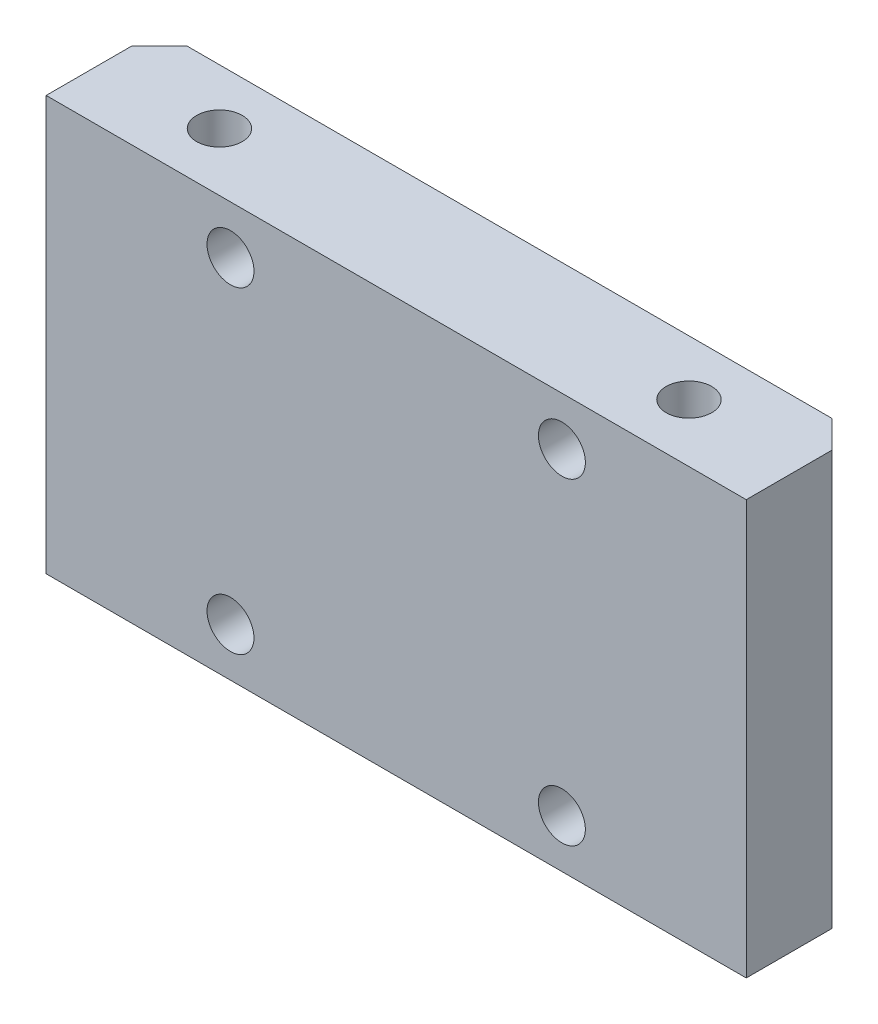
ISO-10303-21;
HEADER;
FILE_DESCRIPTION(('STEP AP214'),'2;1');
FILE_NAME('part.step','',(''),(''),'','','');
FILE_SCHEMA(('AUTOMOTIVE_DESIGN { 1 0 10303 214 1 1 1 1 }'));
ENDSEC;
DATA;
#1=APPLICATION_CONTEXT('core data for automotive mechanical design processes');
#2=APPLICATION_PROTOCOL_DEFINITION('international standard','automotive_design',2000,#1);
#3=PRODUCT_CONTEXT('',#1,'mechanical');
#4=PRODUCT('Part','Part','',(#3));
#5=PRODUCT_RELATED_PRODUCT_CATEGORY('part','',(#4));
#6=PRODUCT_DEFINITION_FORMATION('','',#4);
#7=PRODUCT_DEFINITION_CONTEXT('part definition',#1,'design');
#8=PRODUCT_DEFINITION('design','',#6,#7);
#9=PRODUCT_DEFINITION_SHAPE('','',#8);
#10=(LENGTH_UNIT() NAMED_UNIT(*) SI_UNIT(.MILLI.,.METRE.));
#11=(NAMED_UNIT(*) PLANE_ANGLE_UNIT() SI_UNIT($,.RADIAN.));
#12=(NAMED_UNIT(*) SI_UNIT($,.STERADIAN.) SOLID_ANGLE_UNIT());
#13=UNCERTAINTY_MEASURE_WITH_UNIT(LENGTH_MEASURE(1.E-05),#10,'distance_accuracy_value','');
#14=(GEOMETRIC_REPRESENTATION_CONTEXT(3) GLOBAL_UNCERTAINTY_ASSIGNED_CONTEXT((#13)) GLOBAL_UNIT_ASSIGNED_CONTEXT((#10,
#11,#12)) REPRESENTATION_CONTEXT('',''));
#15=CARTESIAN_POINT('',(0.,0.,0.));
#16=DIRECTION('',(0.,0.,1.));
#17=DIRECTION('',(1.,0.,0.));
#18=AXIS2_PLACEMENT_3D('',#15,#16,#17);
#19=CARTESIAN_POINT('',(0.,0.,449.800000759459));
#20=DIRECTION('',(0.,0.,-1.));
#21=DIRECTION('',(-1.,0.,0.));
#22=AXIS2_PLACEMENT_3D('',#19,#20,#21);
#23=PLANE('',#22);
#24=DIRECTION('',(1.,0.,0.));
#25=VECTOR('',#24,1.);
#26=CARTESIAN_POINT('',(234.649999598707,255.000000702445,449.800000759459));
#27=LINE('',#26,#25);
#28=CARTESIAN_POINT('',(272.,255.000000702445,449.800000759459));
#29=VERTEX_POINT('',#28);
#30=CARTESIAN_POINT('',(283.350000725234,255.000000702445,449.800000759459));
#31=VERTEX_POINT('',#30);
#32=EDGE_CURVE('E137',#29,#31,#27,.T.);
#33=ORIENTED_EDGE('',*,*,#32,.T.);
#34=DIRECTION('',(0.,-1.,0.));
#35=VECTOR('',#34,1.);
#36=CARTESIAN_POINT('',(283.350000725234,0.,449.800000759459));
#37=LINE('',#36,#35);
#38=CARTESIAN_POINT('',(283.350000725234,224.999999182526,449.800000759459));
#39=VERTEX_POINT('',#38);
#40=EDGE_CURVE('E171',#31,#39,#37,.T.);
#41=ORIENTED_EDGE('',*,*,#40,.T.);
#42=DIRECTION('',(-1.,0.,0.));
#43=VECTOR('',#42,1.);
#44=CARTESIAN_POINT('',(285.35000105306,224.999999182526,449.800000759459));
#45=LINE('',#44,#43);
#46=CARTESIAN_POINT('',(272.,224.999999182526,449.800000759459));
#47=VERTEX_POINT('',#46);
#48=EDGE_CURVE('E124',#39,#47,#45,.T.);
#49=ORIENTED_EDGE('',*,*,#48,.T.);
#50=CARTESIAN_POINT('',(272.,228.5,449.800000759459));
#51=DIRECTION('',(0.,0.,-1.));
#52=DIRECTION('',(-1.,0.,0.));
#53=AXIS2_PLACEMENT_3D('',#50,#51,#52);
#54=CIRCLE('',#53,3.50000000000006);
#55=EDGE_CURVE('E156',#47,#47,#54,.F.);
#56=ORIENTED_EDGE('',*,*,#55,.T.);
#57=CARTESIAN_POINT('',(248.,224.999999182526,449.800000759459));
#58=VERTEX_POINT('',#57);
#59=EDGE_CURVE('E126',#47,#58,#45,.T.);
#60=ORIENTED_EDGE('',*,*,#59,.T.);
#61=CARTESIAN_POINT('',(248.,228.5,449.800000759459));
#62=DIRECTION('',(0.,0.,-1.));
#63=DIRECTION('',(-1.,0.,0.));
#64=AXIS2_PLACEMENT_3D('',#61,#62,#63);
#65=CIRCLE('',#64,3.50000000000006);
#66=EDGE_CURVE('E147',#58,#58,#65,.F.);
#67=ORIENTED_EDGE('',*,*,#66,.T.);
#68=CARTESIAN_POINT('',(236.649999926532,224.999999182526,449.800000759459));
#69=VERTEX_POINT('',#68);
#70=EDGE_CURVE('E128',#58,#69,#45,.T.);
#71=ORIENTED_EDGE('',*,*,#70,.T.);
#72=DIRECTION('',(0.,1.,0.));
#73=VECTOR('',#72,1.);
#74=CARTESIAN_POINT('',(236.649999926532,0.,449.800000759459));
#75=LINE('',#74,#73);
#76=CARTESIAN_POINT('',(236.649999926532,255.000000702445,449.800000759459));
#77=VERTEX_POINT('',#76);
#78=EDGE_CURVE('E168',#69,#77,#75,.T.);
#79=ORIENTED_EDGE('',*,*,#78,.T.);
#80=CARTESIAN_POINT('',(248.,255.000000702445,449.800000759459));
#81=VERTEX_POINT('',#80);
#82=EDGE_CURVE('E135',#77,#81,#27,.T.);
#83=ORIENTED_EDGE('',*,*,#82,.T.);
#84=CARTESIAN_POINT('',(248.,251.5,449.800000759459));
#85=DIRECTION('',(0.,0.,-1.));
#86=DIRECTION('',(-1.,0.,0.));
#87=AXIS2_PLACEMENT_3D('',#84,#85,#86);
#88=CIRCLE('',#87,3.50000000000006);
#89=EDGE_CURVE('E153',#81,#81,#88,.F.);
#90=ORIENTED_EDGE('',*,*,#89,.T.);
#91=EDGE_CURVE('E136',#81,#29,#27,.T.);
#92=ORIENTED_EDGE('',*,*,#91,.T.);
#93=CARTESIAN_POINT('',(272.,251.5,449.800000759459));
#94=DIRECTION('',(0.,0.,-1.));
#95=DIRECTION('',(-1.,0.,0.));
#96=AXIS2_PLACEMENT_3D('',#93,#94,#95);
#97=CIRCLE('',#96,3.50000000000006);
#98=EDGE_CURVE('E150',#29,#29,#97,.F.);
#99=ORIENTED_EDGE('',*,*,#98,.T.);
#100=EDGE_LOOP('',(#33,#41,#49,#56,#60,#67,#71,#79,#83,#90,#92,#99));
#101=FACE_BOUND('',#100,.T.);
#102=ADVANCED_FACE('F39',(#101),#23,.T.);
#103=CARTESIAN_POINT('',(234.649999598707,255.000000702445,458.000000799692));
#104=DIRECTION('',(0.,1.,0.));
#105=DIRECTION('',(0.,0.,1.));
#106=AXIS2_PLACEMENT_3D('',#103,#104,#105);
#107=PLANE('',#106);
#108=CARTESIAN_POINT('',(277.000001291955,255.000000702445,453.799999949633));
#109=DIRECTION('',(0.,-1.,0.));
#110=DIRECTION('',(0.,0.,-1.));
#111=AXIS2_PLACEMENT_3D('',#108,#109,#110);
#112=CIRCLE('',#111,1.65000026750434);
#113=CARTESIAN_POINT('',(277.000001291955,255.000000702445,452.149999682129));
#114=VERTEX_POINT('',#113);
#115=EDGE_CURVE('E217',#114,#114,#112,.T.);
#116=ORIENTED_EDGE('',*,*,#115,.T.);
#117=EDGE_LOOP('',(#116));
#118=FACE_BOUND('',#117,.T.);
#119=CARTESIAN_POINT('',(243.000000388583,255.000000702445,453.799999742576));
#120=DIRECTION('',(0.,-1.,0.));
#121=DIRECTION('',(0.,0.,-1.));
#122=AXIS2_PLACEMENT_3D('',#119,#120,#121);
#123=CIRCLE('',#122,1.65000026750431);
#124=CARTESIAN_POINT('',(243.000000388583,255.000000702445,452.149999475072));
#125=VERTEX_POINT('',#124);
#126=EDGE_CURVE('E130',#125,#125,#123,.T.);
#127=ORIENTED_EDGE('',*,*,#126,.T.);
#128=EDGE_LOOP('',(#127));
#129=FACE_BOUND('',#128,.T.);
#130=DIRECTION('',(0.,0.,-1.));
#131=VECTOR('',#130,1.);
#132=CARTESIAN_POINT('',(285.35000105306,255.000000702445,458.000000799692));
#133=LINE('',#132,#131);
#134=CARTESIAN_POINT('',(285.35000105306,255.000000702445,458.000000799692));
#135=VERTEX_POINT('',#134);
#136=CARTESIAN_POINT('',(285.35000105306,255.000000702445,451.800000854454));
#137=VERTEX_POINT('',#136);
#138=EDGE_CURVE('E103',#135,#137,#133,.T.);
#139=ORIENTED_EDGE('',*,*,#138,.T.);
#140=DIRECTION('',(0.707106822345574,0.,0.707106740027519));
#141=VECTOR('',#140,1.);
#142=CARTESIAN_POINT('',(263.099997347374,255.000000702445,429.549999739009));
#143=LINE('',#142,#141);
#144=EDGE_CURVE('E48',#137,#31,#143,.F.);
#145=ORIENTED_EDGE('',*,*,#144,.T.);
#146=ORIENTED_EDGE('',*,*,#32,.F.);
#147=ORIENTED_EDGE('',*,*,#91,.F.);
#148=ORIENTED_EDGE('',*,*,#82,.F.);
#149=DIRECTION('',(0.707106822345579,0.,-0.707106740027514));
#150=VECTOR('',#149,1.);
#151=CARTESIAN_POINT('',(231.549999626087,255.000000702445,454.900000466185));
#152=LINE('',#151,#150);
#153=CARTESIAN_POINT('',(234.649999598707,255.000000702445,451.800000854454));
#154=VERTEX_POINT('',#153);
#155=EDGE_CURVE('E55',#77,#154,#152,.F.);
#156=ORIENTED_EDGE('',*,*,#155,.T.);
#157=DIRECTION('',(0.,0.,-1.));
#158=VECTOR('',#157,1.);
#159=CARTESIAN_POINT('',(234.649999598707,255.000000702445,458.000000799692));
#160=LINE('',#159,#158);
#161=CARTESIAN_POINT('',(234.649999598707,255.000000702445,458.000000799692));
#162=VERTEX_POINT('',#161);
#163=EDGE_CURVE('E123',#162,#154,#160,.T.);
#164=ORIENTED_EDGE('',*,*,#163,.F.);
#165=DIRECTION('',(1.,0.,0.));
#166=VECTOR('',#165,1.);
#167=CARTESIAN_POINT('',(234.649999598707,255.000000702445,458.000000799692));
#168=LINE('',#167,#166);
#169=EDGE_CURVE('E117',#162,#135,#168,.T.);
#170=ORIENTED_EDGE('',*,*,#169,.T.);
#171=EDGE_LOOP('',(#139,#145,#146,#147,#148,#156,#164,#170));
#172=FACE_BOUND('',#171,.T.);
#173=ADVANCED_FACE('F122',(#118,#129,#172),#107,.T.);
#174=CARTESIAN_POINT('',(234.649999598707,224.999999182526,458.000000799692));
#175=DIRECTION('',(-1.,0.,0.));
#176=DIRECTION('',(0.,0.,1.));
#177=AXIS2_PLACEMENT_3D('',#174,#175,#176);
#178=PLANE('',#177);
#179=ORIENTED_EDGE('',*,*,#163,.T.);
#180=DIRECTION('',(0.,-1.,0.));
#181=VECTOR('',#180,1.);
#182=CARTESIAN_POINT('',(234.649999598707,224.999999182526,451.800000854454));
#183=LINE('',#182,#181);
#184=CARTESIAN_POINT('',(234.649999598707,224.999999182526,451.800000854454));
#185=VERTEX_POINT('',#184);
#186=EDGE_CURVE('E11',#154,#185,#183,.T.);
#187=ORIENTED_EDGE('',*,*,#186,.T.);
#188=DIRECTION('',(0.,0.,-1.));
#189=VECTOR('',#188,1.);
#190=CARTESIAN_POINT('',(234.649999598707,224.999999182526,458.000000799692));
#191=LINE('',#190,#189);
#192=CARTESIAN_POINT('',(234.649999598707,224.999999182526,458.000000799692));
#193=VERTEX_POINT('',#192);
#194=EDGE_CURVE('E141',#193,#185,#191,.T.);
#195=ORIENTED_EDGE('',*,*,#194,.F.);
#196=DIRECTION('',(0.,1.,0.));
#197=VECTOR('',#196,1.);
#198=CARTESIAN_POINT('',(234.649999598707,224.999999182526,458.000000799692));
#199=LINE('',#198,#197);
#200=EDGE_CURVE('E110',#193,#162,#199,.T.);
#201=ORIENTED_EDGE('',*,*,#200,.T.);
#202=EDGE_LOOP('',(#179,#187,#195,#201));
#203=FACE_BOUND('',#202,.T.);
#204=ADVANCED_FACE('F249',(#203),#178,.T.);
#205=CARTESIAN_POINT('',(285.35000105306,224.999999182526,458.000000799692));
#206=DIRECTION('',(0.,-1.,0.));
#207=DIRECTION('',(0.,0.,-1.));
#208=AXIS2_PLACEMENT_3D('',#205,#206,#207);
#209=PLANE('',#208);
#210=CARTESIAN_POINT('',(277.000001291955,224.999999182526,453.799999949633));
#211=DIRECTION('',(0.,-1.,0.));
#212=DIRECTION('',(0.,0.,-1.));
#213=AXIS2_PLACEMENT_3D('',#210,#211,#212);
#214=CIRCLE('',#213,1.65000026750434);
#215=CARTESIAN_POINT('',(277.000001291955,224.999999182526,452.149999682129));
#216=VERTEX_POINT('',#215);
#217=EDGE_CURVE('E213',#216,#216,#214,.T.);
#218=ORIENTED_EDGE('',*,*,#217,.F.);
#219=EDGE_LOOP('',(#218));
#220=FACE_BOUND('',#219,.T.);
#221=CARTESIAN_POINT('',(243.000000388583,224.999999182526,453.799999742576));
#222=DIRECTION('',(0.,-1.,0.));
#223=DIRECTION('',(0.,0.,-1.));
#224=AXIS2_PLACEMENT_3D('',#221,#222,#223);
#225=CIRCLE('',#224,1.65000026750434);
#226=CARTESIAN_POINT('',(243.000000388583,224.999999182526,452.149999475072));
#227=VERTEX_POINT('',#226);
#228=EDGE_CURVE('E225',#227,#227,#225,.T.);
#229=ORIENTED_EDGE('',*,*,#228,.F.);
#230=EDGE_LOOP('',(#229));
#231=FACE_BOUND('',#230,.T.);
#232=ORIENTED_EDGE('',*,*,#48,.F.);
#233=DIRECTION('',(-0.707106822345574,0.,-0.707106740027519));
#234=VECTOR('',#233,1.);
#235=CARTESIAN_POINT('',(288.450001025679,224.999999182526,454.900000466186));
#236=LINE('',#235,#234);
#237=CARTESIAN_POINT('',(285.35000105306,224.999999182526,451.800000854454));
#238=VERTEX_POINT('',#237);
#239=EDGE_CURVE('E176',#39,#238,#236,.F.);
#240=ORIENTED_EDGE('',*,*,#239,.T.);
#241=DIRECTION('',(0.,0.,-1.));
#242=VECTOR('',#241,1.);
#243=CARTESIAN_POINT('',(285.35000105306,224.999999182526,458.000000799692));
#244=LINE('',#243,#242);
#245=CARTESIAN_POINT('',(285.35000105306,224.999999182526,458.000000799692));
#246=VERTEX_POINT('',#245);
#247=EDGE_CURVE('E109',#246,#238,#244,.T.);
#248=ORIENTED_EDGE('',*,*,#247,.F.);
#249=DIRECTION('',(-1.,0.,0.));
#250=VECTOR('',#249,1.);
#251=CARTESIAN_POINT('',(285.35000105306,224.999999182526,458.000000799692));
#252=LINE('',#251,#250);
#253=EDGE_CURVE('E120',#246,#193,#252,.T.);
#254=ORIENTED_EDGE('',*,*,#253,.T.);
#255=ORIENTED_EDGE('',*,*,#194,.T.);
#256=DIRECTION('',(-0.707106822345579,0.,0.707106740027514));
#257=VECTOR('',#256,1.);
#258=CARTESIAN_POINT('',(256.900003304392,224.999999182526,429.549999739009));
#259=LINE('',#258,#257);
#260=EDGE_CURVE('E174',#185,#69,#259,.F.);
#261=ORIENTED_EDGE('',*,*,#260,.T.);
#262=ORIENTED_EDGE('',*,*,#70,.F.);
#263=ORIENTED_EDGE('',*,*,#59,.F.);
#264=EDGE_LOOP('',(#232,#240,#248,#254,#255,#261,#262,#263));
#265=FACE_BOUND('',#264,.T.);
#266=ADVANCED_FACE('F189',(#220,#231,#265),#209,.T.);
#267=CARTESIAN_POINT('',(285.35000105306,255.000000702445,458.000000799692));
#268=DIRECTION('',(1.,0.,0.));
#269=DIRECTION('',(0.,0.,-1.));
#270=AXIS2_PLACEMENT_3D('',#267,#268,#269);
#271=PLANE('',#270);
#272=ORIENTED_EDGE('',*,*,#247,.T.);
#273=DIRECTION('',(0.,1.,0.));
#274=VECTOR('',#273,1.);
#275=CARTESIAN_POINT('',(285.35000105306,255.000000702445,451.800000854454));
#276=LINE('',#275,#274);
#277=EDGE_CURVE('E63',#238,#137,#276,.T.);
#278=ORIENTED_EDGE('',*,*,#277,.T.);
#279=ORIENTED_EDGE('',*,*,#138,.F.);
#280=DIRECTION('',(0.,-1.,0.));
#281=VECTOR('',#280,1.);
#282=CARTESIAN_POINT('',(285.35000105306,255.000000702445,458.000000799692));
#283=LINE('',#282,#281);
#284=EDGE_CURVE('E106',#135,#246,#283,.T.);
#285=ORIENTED_EDGE('',*,*,#284,.T.);
#286=EDGE_LOOP('',(#272,#278,#279,#285));
#287=FACE_BOUND('',#286,.T.);
#288=ADVANCED_FACE('F105',(#287),#271,.T.);
#289=CARTESIAN_POINT('',(0.,0.,458.000000799692));
#290=DIRECTION('',(0.,0.,-1.));
#291=DIRECTION('',(-1.,0.,0.));
#292=AXIS2_PLACEMENT_3D('',#289,#290,#291);
#293=PLANE('',#292);
#294=CARTESIAN_POINT('',(248.,251.5,458.000000799692));
#295=DIRECTION('',(0.,0.,1.));
#296=DIRECTION('',(1.,0.,0.));
#297=AXIS2_PLACEMENT_3D('',#294,#295,#296);
#298=CIRCLE('',#297,1.70000000000001);
#299=CARTESIAN_POINT('',(249.7,251.5,458.000000799692));
#300=VERTEX_POINT('',#299);
#301=EDGE_CURVE('E420',#300,#300,#298,.T.);
#302=ORIENTED_EDGE('',*,*,#301,.F.);
#303=EDGE_LOOP('',(#302));
#304=FACE_BOUND('',#303,.T.);
#305=CARTESIAN_POINT('',(248.,228.5,458.000000799692));
#306=DIRECTION('',(0.,0.,1.));
#307=DIRECTION('',(1.,0.,0.));
#308=AXIS2_PLACEMENT_3D('',#305,#306,#307);
#309=CIRCLE('',#308,1.70000000000001);
#310=CARTESIAN_POINT('',(249.7,228.5,458.000000799692));
#311=VERTEX_POINT('',#310);
#312=EDGE_CURVE('E220',#311,#311,#309,.T.);
#313=ORIENTED_EDGE('',*,*,#312,.F.);
#314=EDGE_LOOP('',(#313));
#315=FACE_BOUND('',#314,.T.);
#316=CARTESIAN_POINT('',(272.,251.5,458.000000799692));
#317=DIRECTION('',(0.,0.,-1.));
#318=DIRECTION('',(-1.,0.,0.));
#319=AXIS2_PLACEMENT_3D('',#316,#317,#318);
#320=CIRCLE('',#319,1.69999999999998);
#321=CARTESIAN_POINT('',(270.3,251.5,458.000000799692));
#322=VERTEX_POINT('',#321);
#323=EDGE_CURVE('E214',#322,#322,#320,.T.);
#324=ORIENTED_EDGE('',*,*,#323,.T.);
#325=EDGE_LOOP('',(#324));
#326=FACE_BOUND('',#325,.T.);
#327=CARTESIAN_POINT('',(272.,228.5,458.000000799692));
#328=DIRECTION('',(0.,0.,-1.));
#329=DIRECTION('',(-1.,0.,0.));
#330=AXIS2_PLACEMENT_3D('',#327,#328,#329);
#331=CIRCLE('',#330,1.69999999999998);
#332=CARTESIAN_POINT('',(270.3,228.5,458.000000799692));
#333=VERTEX_POINT('',#332);
#334=EDGE_CURVE('E211',#333,#333,#331,.T.);
#335=ORIENTED_EDGE('',*,*,#334,.T.);
#336=EDGE_LOOP('',(#335));
#337=FACE_BOUND('',#336,.T.);
#338=ORIENTED_EDGE('',*,*,#169,.F.);
#339=ORIENTED_EDGE('',*,*,#200,.F.);
#340=ORIENTED_EDGE('',*,*,#253,.F.);
#341=ORIENTED_EDGE('',*,*,#284,.F.);
#342=EDGE_LOOP('',(#338,#339,#340,#341));
#343=FACE_BOUND('',#342,.T.);
#344=ADVANCED_FACE('F115',(#304,#315,#326,#337,#343),#293,.F.);
#345=CARTESIAN_POINT('',(243.000000388583,224.999999182526,453.799999742576));
#346=DIRECTION('',(0.,-1.,0.));
#347=DIRECTION('',(0.,0.,-1.));
#348=AXIS2_PLACEMENT_3D('',#345,#346,#347);
#349=CYLINDRICAL_SURFACE('',#348,1.65000026750432);
#350=ORIENTED_EDGE('',*,*,#126,.F.);
#351=EDGE_LOOP('',(#350));
#352=FACE_BOUND('',#351,.T.);
#353=ORIENTED_EDGE('',*,*,#228,.T.);
#354=EDGE_LOOP('',(#353));
#355=FACE_BOUND('',#354,.T.);
#356=ADVANCED_FACE('F233',(#352,#355),#349,.F.);
#357=CARTESIAN_POINT('',(277.000001291955,224.999999182526,453.799999949633));
#358=DIRECTION('',(0.,-1.,0.));
#359=DIRECTION('',(0.,0.,-1.));
#360=AXIS2_PLACEMENT_3D('',#357,#358,#359);
#361=CYLINDRICAL_SURFACE('',#360,1.65000026750434);
#362=ORIENTED_EDGE('',*,*,#115,.F.);
#363=EDGE_LOOP('',(#362));
#364=FACE_BOUND('',#363,.T.);
#365=ORIENTED_EDGE('',*,*,#217,.T.);
#366=EDGE_LOOP('',(#365));
#367=FACE_BOUND('',#366,.T.);
#368=ADVANCED_FACE('F207',(#364,#367),#361,.F.);
#369=CARTESIAN_POINT('',(272.,228.5,449.800000759459));
#370=DIRECTION('',(0.,0.,-1.));
#371=DIRECTION('',(-1.,0.,0.));
#372=AXIS2_PLACEMENT_3D('',#369,#370,#371);
#373=CYLINDRICAL_SURFACE('',#372,1.69999999999998);
#374=CARTESIAN_POINT('',(272.,228.5,451.600000759459));
#375=DIRECTION('',(0.,0.,-1.));
#376=DIRECTION('',(-1.,0.,0.));
#377=AXIS2_PLACEMENT_3D('',#374,#375,#376);
#378=CIRCLE('',#377,1.69999999999998);
#379=CARTESIAN_POINT('',(270.3,228.5,451.600000759459));
#380=VERTEX_POINT('',#379);
#381=EDGE_CURVE('E140',#380,#380,#378,.T.);
#382=ORIENTED_EDGE('',*,*,#381,.T.);
#383=EDGE_LOOP('',(#382));
#384=FACE_BOUND('',#383,.T.);
#385=ORIENTED_EDGE('',*,*,#334,.F.);
#386=EDGE_LOOP('',(#385));
#387=FACE_BOUND('',#386,.T.);
#388=ADVANCED_FACE('F203',(#384,#387),#373,.F.);
#389=CARTESIAN_POINT('',(272.,251.5,449.800000759459));
#390=DIRECTION('',(0.,0.,-1.));
#391=DIRECTION('',(-1.,0.,0.));
#392=AXIS2_PLACEMENT_3D('',#389,#390,#391);
#393=CYLINDRICAL_SURFACE('',#392,1.69999999999998);
#394=CARTESIAN_POINT('',(272.,251.5,451.600000759459));
#395=DIRECTION('',(0.,0.,-1.));
#396=DIRECTION('',(-1.,0.,0.));
#397=AXIS2_PLACEMENT_3D('',#394,#395,#396);
#398=CIRCLE('',#397,1.69999999999998);
#399=CARTESIAN_POINT('',(270.3,251.5,451.600000759459));
#400=VERTEX_POINT('',#399);
#401=EDGE_CURVE('E162',#400,#400,#398,.T.);
#402=ORIENTED_EDGE('',*,*,#401,.T.);
#403=EDGE_LOOP('',(#402));
#404=FACE_BOUND('',#403,.T.);
#405=ORIENTED_EDGE('',*,*,#323,.F.);
#406=EDGE_LOOP('',(#405));
#407=FACE_BOUND('',#406,.T.);
#408=ADVANCED_FACE('F206',(#404,#407),#393,.F.);
#409=CARTESIAN_POINT('',(248.,228.5,458.000000799692));
#410=DIRECTION('',(0.,0.,1.));
#411=DIRECTION('',(1.,0.,0.));
#412=AXIS2_PLACEMENT_3D('',#409,#410,#411);
#413=CYLINDRICAL_SURFACE('',#412,1.70000000000001);
#414=CARTESIAN_POINT('',(248.,228.5,451.600000759459));
#415=DIRECTION('',(0.,0.,-1.));
#416=DIRECTION('',(-1.,0.,0.));
#417=AXIS2_PLACEMENT_3D('',#414,#415,#416);
#418=CIRCLE('',#417,1.70000000000001);
#419=CARTESIAN_POINT('',(246.3,228.5,451.600000759459));
#420=VERTEX_POINT('',#419);
#421=EDGE_CURVE('E165',#420,#420,#418,.T.);
#422=ORIENTED_EDGE('',*,*,#421,.T.);
#423=EDGE_LOOP('',(#422));
#424=FACE_BOUND('',#423,.T.);
#425=ORIENTED_EDGE('',*,*,#312,.T.);
#426=EDGE_LOOP('',(#425));
#427=FACE_BOUND('',#426,.T.);
#428=ADVANCED_FACE('F368',(#424,#427),#413,.F.);
#429=CARTESIAN_POINT('',(248.,251.5,458.000000799692));
#430=DIRECTION('',(0.,0.,1.));
#431=DIRECTION('',(1.,0.,0.));
#432=AXIS2_PLACEMENT_3D('',#429,#430,#431);
#433=CYLINDRICAL_SURFACE('',#432,1.70000000000001);
#434=CARTESIAN_POINT('',(248.,251.5,451.600000759459));
#435=DIRECTION('',(0.,0.,-1.));
#436=DIRECTION('',(-1.,0.,0.));
#437=AXIS2_PLACEMENT_3D('',#434,#435,#436);
#438=CIRCLE('',#437,1.70000000000001);
#439=CARTESIAN_POINT('',(246.3,251.5,451.600000759459));
#440=VERTEX_POINT('',#439);
#441=EDGE_CURVE('E159',#440,#440,#438,.T.);
#442=ORIENTED_EDGE('',*,*,#441,.T.);
#443=EDGE_LOOP('',(#442));
#444=FACE_BOUND('',#443,.T.);
#445=ORIENTED_EDGE('',*,*,#301,.T.);
#446=EDGE_LOOP('',(#445));
#447=FACE_BOUND('',#446,.T.);
#448=ADVANCED_FACE('F199',(#444,#447),#433,.F.);
#449=CARTESIAN_POINT('',(272.,228.5,451.600000759459));
#450=DIRECTION('',(0.,0.,-1.));
#451=DIRECTION('',(-1.,0.,0.));
#452=AXIS2_PLACEMENT_3D('',#449,#450,#451);
#453=CONICAL_SURFACE('',#452,1.69999999999998,0.785398163397448);
#454=ORIENTED_EDGE('',*,*,#55,.F.);
#455=EDGE_LOOP('',(#454));
#456=FACE_BOUND('',#455,.T.);
#457=ORIENTED_EDGE('',*,*,#381,.F.);
#458=EDGE_LOOP('',(#457));
#459=FACE_BOUND('',#458,.T.);
#460=ADVANCED_FACE('F195',(#456,#459),#453,.F.);
#461=CARTESIAN_POINT('',(248.,251.5,449.800000759459));
#462=DIRECTION('',(0.,0.,-1.));
#463=DIRECTION('',(-1.,0.,0.));
#464=AXIS2_PLACEMENT_3D('',#461,#462,#463);
#465=CONICAL_SURFACE('',#464,3.50000000000006,0.785398163397456);
#466=ORIENTED_EDGE('',*,*,#441,.F.);
#467=EDGE_LOOP('',(#466));
#468=FACE_BOUND('',#467,.T.);
#469=ORIENTED_EDGE('',*,*,#89,.F.);
#470=EDGE_LOOP('',(#469));
#471=FACE_BOUND('',#470,.T.);
#472=ADVANCED_FACE('F198',(#468,#471),#465,.F.);
#473=CARTESIAN_POINT('',(272.,251.5,451.600000759459));
#474=DIRECTION('',(0.,0.,-1.));
#475=DIRECTION('',(-1.,0.,0.));
#476=AXIS2_PLACEMENT_3D('',#473,#474,#475);
#477=CONICAL_SURFACE('',#476,1.69999999999998,0.785398163397448);
#478=ORIENTED_EDGE('',*,*,#98,.F.);
#479=EDGE_LOOP('',(#478));
#480=FACE_BOUND('',#479,.T.);
#481=ORIENTED_EDGE('',*,*,#401,.F.);
#482=EDGE_LOOP('',(#481));
#483=FACE_BOUND('',#482,.T.);
#484=ADVANCED_FACE('F270',(#480,#483),#477,.F.);
#485=CARTESIAN_POINT('',(248.,228.5,449.800000759459));
#486=DIRECTION('',(0.,0.,-1.));
#487=DIRECTION('',(-1.,0.,0.));
#488=AXIS2_PLACEMENT_3D('',#485,#486,#487);
#489=CONICAL_SURFACE('',#488,3.50000000000006,0.785398163397456);
#490=ORIENTED_EDGE('',*,*,#421,.F.);
#491=EDGE_LOOP('',(#490));
#492=FACE_BOUND('',#491,.T.);
#493=ORIENTED_EDGE('',*,*,#66,.F.);
#494=EDGE_LOOP('',(#493));
#495=FACE_BOUND('',#494,.T.);
#496=ADVANCED_FACE('F277',(#492,#495),#489,.F.);
#497=CARTESIAN_POINT('',(283.350000725234,0.,449.800000759459));
#498=DIRECTION('',(-0.707106740027519,0.,0.707106822345574));
#499=DIRECTION('',(0.,-1.,0.));
#500=AXIS2_PLACEMENT_3D('',#497,#498,#499);
#501=PLANE('',#500);
#502=ORIENTED_EDGE('',*,*,#144,.F.);
#503=ORIENTED_EDGE('',*,*,#277,.F.);
#504=ORIENTED_EDGE('',*,*,#239,.F.);
#505=ORIENTED_EDGE('',*,*,#40,.F.);
#506=EDGE_LOOP('',(#502,#503,#504,#505));
#507=FACE_BOUND('',#506,.T.);
#508=ADVANCED_FACE('F187',(#507),#501,.F.);
#509=CARTESIAN_POINT('',(236.649999926532,0.,449.800000759459));
#510=DIRECTION('',(0.707106740027514,0.,0.707106822345579));
#511=DIRECTION('',(0.,1.,0.));
#512=AXIS2_PLACEMENT_3D('',#509,#510,#511);
#513=PLANE('',#512);
#514=ORIENTED_EDGE('',*,*,#260,.F.);
#515=ORIENTED_EDGE('',*,*,#186,.F.);
#516=ORIENTED_EDGE('',*,*,#155,.F.);
#517=ORIENTED_EDGE('',*,*,#78,.F.);
#518=EDGE_LOOP('',(#514,#515,#516,#517));
#519=FACE_BOUND('',#518,.T.);
#520=ADVANCED_FACE('F42',(#519),#513,.F.);
#521=CLOSED_SHELL('',(#102,#173,#204,#266,#288,#344,#356,#368,#388,#408,#428,#448,#460,#472,
#484,#496,#508,#520));
#522=MANIFOLD_SOLID_BREP('B2',#521);
#523=ADVANCED_BREP_SHAPE_REPRESENTATION('',(#18,#522),#14);
#524=SHAPE_DEFINITION_REPRESENTATION(#9,#523);
ENDSEC;
END-ISO-10303-21;
